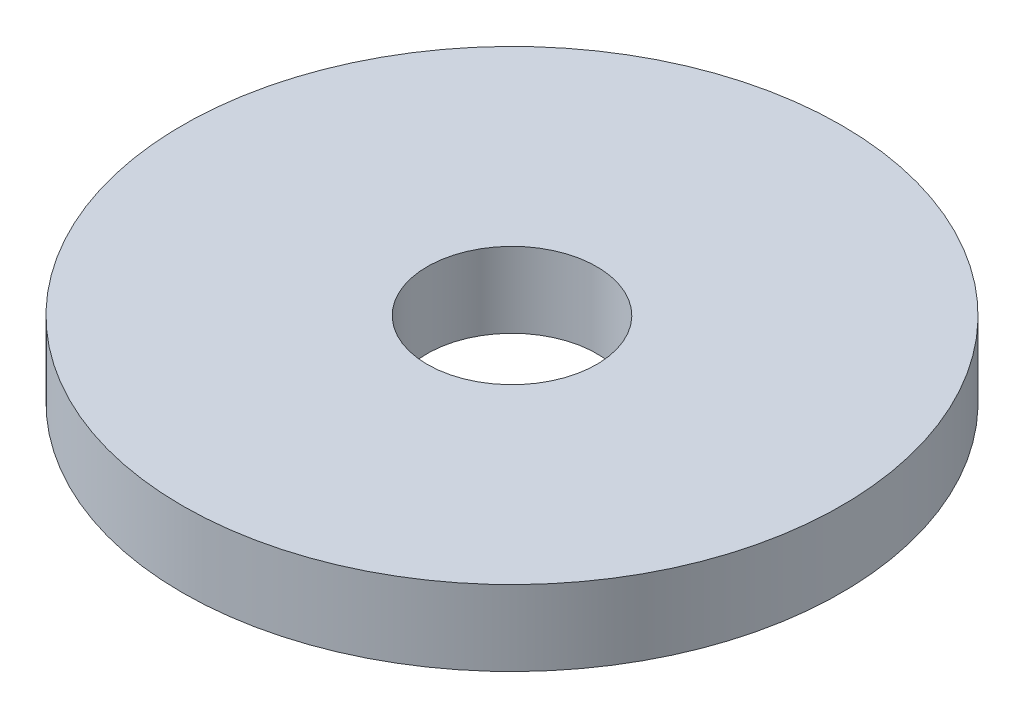
ISO-10303-21;
HEADER;
FILE_DESCRIPTION(('STEP AP214'),'2;1');
FILE_NAME('part.step','',(''),(''),'','','');
FILE_SCHEMA(('AUTOMOTIVE_DESIGN { 1 0 10303 214 1 1 1 1 }'));
ENDSEC;
DATA;
#1=APPLICATION_CONTEXT('core data for automotive mechanical design processes');
#2=APPLICATION_PROTOCOL_DEFINITION('international standard','automotive_design',2000,#1);
#3=PRODUCT_CONTEXT('',#1,'mechanical');
#4=PRODUCT('Part','Part','',(#3));
#5=PRODUCT_RELATED_PRODUCT_CATEGORY('part','',(#4));
#6=PRODUCT_DEFINITION_FORMATION('','',#4);
#7=PRODUCT_DEFINITION_CONTEXT('part definition',#1,'design');
#8=PRODUCT_DEFINITION('design','',#6,#7);
#9=PRODUCT_DEFINITION_SHAPE('','',#8);
#10=(LENGTH_UNIT() NAMED_UNIT(*) SI_UNIT(.MILLI.,.METRE.));
#11=(NAMED_UNIT(*) PLANE_ANGLE_UNIT() SI_UNIT($,.RADIAN.));
#12=(NAMED_UNIT(*) SI_UNIT($,.STERADIAN.) SOLID_ANGLE_UNIT());
#13=UNCERTAINTY_MEASURE_WITH_UNIT(LENGTH_MEASURE(1.E-05),#10,'distance_accuracy_value','');
#14=(GEOMETRIC_REPRESENTATION_CONTEXT(3) GLOBAL_UNCERTAINTY_ASSIGNED_CONTEXT((#13)) GLOBAL_UNIT_ASSIGNED_CONTEXT((#10,
#11,#12)) REPRESENTATION_CONTEXT('',''));
#15=CARTESIAN_POINT('',(0.,0.,0.));
#16=DIRECTION('',(0.,0.,1.));
#17=DIRECTION('',(1.,0.,0.));
#18=AXIS2_PLACEMENT_3D('',#15,#16,#17);
#19=CARTESIAN_POINT('',(0.,0.8,0.));
#20=DIRECTION('',(0.,1.,0.));
#21=DIRECTION('',(0.,0.,1.));
#22=AXIS2_PLACEMENT_3D('',#19,#20,#21);
#23=PLANE('',#22);
#24=CARTESIAN_POINT('',(0.,0.8,0.));
#25=DIRECTION('',(0.,1.,0.));
#26=DIRECTION('',(0.,0.,1.));
#27=AXIS2_PLACEMENT_3D('',#24,#25,#26);
#28=CIRCLE('',#27,3.5);
#29=CARTESIAN_POINT('',(0.,0.8,3.5));
#30=VERTEX_POINT('',#29);
#31=EDGE_CURVE('E10',#30,#30,#28,.T.);
#32=ORIENTED_EDGE('',*,*,#31,.T.);
#33=EDGE_LOOP('',(#32));
#34=FACE_BOUND('',#33,.T.);
#35=CARTESIAN_POINT('',(0.,0.8,0.));
#36=DIRECTION('',(0.,1.,0.));
#37=DIRECTION('',(0.,0.,1.));
#38=AXIS2_PLACEMENT_3D('',#35,#36,#37);
#39=CIRCLE('',#38,0.9);
#40=CARTESIAN_POINT('',(0.,0.8,0.9));
#41=VERTEX_POINT('',#40);
#42=EDGE_CURVE('E44',#41,#41,#39,.T.);
#43=ORIENTED_EDGE('',*,*,#42,.F.);
#44=EDGE_LOOP('',(#43));
#45=FACE_BOUND('',#44,.T.);
#46=ADVANCED_FACE('F33',(#34,#45),#23,.T.);
#47=CARTESIAN_POINT('',(0.,0.,0.));
#48=DIRECTION('',(0.,1.,0.));
#49=DIRECTION('',(0.,0.,1.));
#50=AXIS2_PLACEMENT_3D('',#47,#48,#49);
#51=PLANE('',#50);
#52=CARTESIAN_POINT('',(0.,0.,0.));
#53=DIRECTION('',(0.,1.,0.));
#54=DIRECTION('',(0.,0.,1.));
#55=AXIS2_PLACEMENT_3D('',#52,#53,#54);
#56=CIRCLE('',#55,3.5);
#57=CARTESIAN_POINT('',(0.,0.,3.5));
#58=VERTEX_POINT('',#57);
#59=EDGE_CURVE('E37',#58,#58,#56,.T.);
#60=ORIENTED_EDGE('',*,*,#59,.F.);
#61=EDGE_LOOP('',(#60));
#62=FACE_BOUND('',#61,.T.);
#63=CARTESIAN_POINT('',(0.,0.,0.));
#64=DIRECTION('',(0.,1.,0.));
#65=DIRECTION('',(0.,0.,1.));
#66=AXIS2_PLACEMENT_3D('',#63,#64,#65);
#67=CIRCLE('',#66,0.9);
#68=CARTESIAN_POINT('',(0.,0.,0.9));
#69=VERTEX_POINT('',#68);
#70=EDGE_CURVE('E46',#69,#69,#67,.T.);
#71=ORIENTED_EDGE('',*,*,#70,.T.);
#72=EDGE_LOOP('',(#71));
#73=FACE_BOUND('',#72,.T.);
#74=ADVANCED_FACE('F56',(#62,#73),#51,.F.);
#75=CARTESIAN_POINT('',(0.,0.8,0.));
#76=DIRECTION('',(0.,-1.,0.));
#77=DIRECTION('',(0.,0.,-1.));
#78=AXIS2_PLACEMENT_3D('',#75,#76,#77);
#79=CYLINDRICAL_SURFACE('',#78,3.5);
#80=ORIENTED_EDGE('',*,*,#31,.F.);
#81=EDGE_LOOP('',(#80));
#82=FACE_BOUND('',#81,.T.);
#83=ORIENTED_EDGE('',*,*,#59,.T.);
#84=EDGE_LOOP('',(#83));
#85=FACE_BOUND('',#84,.T.);
#86=ADVANCED_FACE('F35',(#82,#85),#79,.T.);
#87=CARTESIAN_POINT('',(0.,0.8,0.));
#88=DIRECTION('',(0.,-1.,0.));
#89=DIRECTION('',(0.,0.,-1.));
#90=AXIS2_PLACEMENT_3D('',#87,#88,#89);
#91=CYLINDRICAL_SURFACE('',#90,0.9);
#92=ORIENTED_EDGE('',*,*,#42,.T.);
#93=EDGE_LOOP('',(#92));
#94=FACE_BOUND('',#93,.T.);
#95=ORIENTED_EDGE('',*,*,#70,.F.);
#96=EDGE_LOOP('',(#95));
#97=FACE_BOUND('',#96,.T.);
#98=ADVANCED_FACE('F52',(#94,#97),#91,.F.);
#99=CLOSED_SHELL('',(#46,#74,#86,#98));
#100=MANIFOLD_SOLID_BREP('B2',#99);
#101=ADVANCED_BREP_SHAPE_REPRESENTATION('',(#18,#100),#14);
#102=SHAPE_DEFINITION_REPRESENTATION(#9,#101);
ENDSEC;
END-ISO-10303-21;
